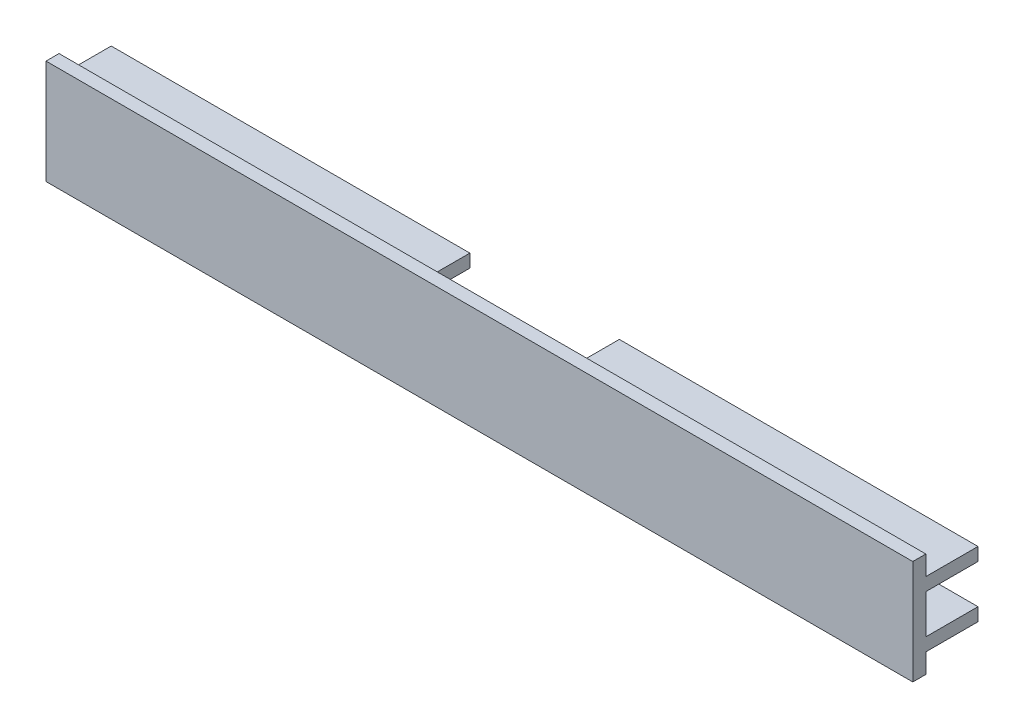
ISO-10303-21;
HEADER;
FILE_DESCRIPTION(('STEP AP214'),'2;1');
FILE_NAME('part.step','',(''),(''),'','','');
FILE_SCHEMA(('AUTOMOTIVE_DESIGN { 1 0 10303 214 1 1 1 1 }'));
ENDSEC;
DATA;
#1=APPLICATION_CONTEXT('core data for automotive mechanical design processes');
#2=APPLICATION_PROTOCOL_DEFINITION('international standard','automotive_design',2000,#1);
#3=PRODUCT_CONTEXT('',#1,'mechanical');
#4=PRODUCT('Part','Part','',(#3));
#5=PRODUCT_RELATED_PRODUCT_CATEGORY('part','',(#4));
#6=PRODUCT_DEFINITION_FORMATION('','',#4);
#7=PRODUCT_DEFINITION_CONTEXT('part definition',#1,'design');
#8=PRODUCT_DEFINITION('design','',#6,#7);
#9=PRODUCT_DEFINITION_SHAPE('','',#8);
#10=(LENGTH_UNIT() NAMED_UNIT(*) SI_UNIT(.MILLI.,.METRE.));
#11=(NAMED_UNIT(*) PLANE_ANGLE_UNIT() SI_UNIT($,.RADIAN.));
#12=(NAMED_UNIT(*) SI_UNIT($,.STERADIAN.) SOLID_ANGLE_UNIT());
#13=UNCERTAINTY_MEASURE_WITH_UNIT(LENGTH_MEASURE(1.E-05),#10,'distance_accuracy_value','');
#14=(GEOMETRIC_REPRESENTATION_CONTEXT(3) GLOBAL_UNCERTAINTY_ASSIGNED_CONTEXT((#13)) GLOBAL_UNIT_ASSIGNED_CONTEXT((#10,
#11,#12)) REPRESENTATION_CONTEXT('',''));
#15=CARTESIAN_POINT('',(0.,0.,0.));
#16=DIRECTION('',(0.,0.,1.));
#17=DIRECTION('',(1.,0.,0.));
#18=AXIS2_PLACEMENT_3D('',#15,#16,#17);
#19=CARTESIAN_POINT('',(66.46,-3.,-5.));
#20=DIRECTION('',(0.,0.,1.));
#21=DIRECTION('',(1.,0.,0.));
#22=AXIS2_PLACEMENT_3D('',#19,#20,#21);
#23=PLANE('',#22);
#24=DIRECTION('',(-1.,0.,0.));
#25=VECTOR('',#24,1.);
#26=CARTESIAN_POINT('',(66.46,-5.,-5.));
#27=LINE('',#26,#25);
#28=CARTESIAN_POINT('',(66.46,-5.,-5.));
#29=VERTEX_POINT('',#28);
#30=CARTESIAN_POINT('',(11.46,-5.,-5.));
#31=VERTEX_POINT('',#30);
#32=EDGE_CURVE('E355',#29,#31,#27,.T.);
#33=ORIENTED_EDGE('',*,*,#32,.T.);
#34=DIRECTION('',(0.,-1.,0.));
#35=VECTOR('',#34,1.);
#36=CARTESIAN_POINT('',(11.46,5.,-5.));
#37=LINE('',#36,#35);
#38=CARTESIAN_POINT('',(11.46,-3.,-5.));
#39=VERTEX_POINT('',#38);
#40=EDGE_CURVE('E421',#39,#31,#37,.T.);
#41=ORIENTED_EDGE('',*,*,#40,.F.);
#42=DIRECTION('',(-1.,0.,0.));
#43=VECTOR('',#42,1.);
#44=CARTESIAN_POINT('',(66.46,-3.,-5.));
#45=LINE('',#44,#43);
#46=CARTESIAN_POINT('',(66.46,-3.,-5.));
#47=VERTEX_POINT('',#46);
#48=EDGE_CURVE('E351',#47,#39,#45,.T.);
#49=ORIENTED_EDGE('',*,*,#48,.F.);
#50=DIRECTION('',(0.,1.,0.));
#51=VECTOR('',#50,1.);
#52=CARTESIAN_POINT('',(66.46,-3.,-5.));
#53=LINE('',#52,#51);
#54=EDGE_CURVE('E296',#29,#47,#53,.T.);
#55=ORIENTED_EDGE('',*,*,#54,.F.);
#56=EDGE_LOOP('',(#33,#41,#49,#55));
#57=FACE_BOUND('',#56,.T.);
#58=ADVANCED_FACE('F34',(#57),#23,.F.);
#59=CARTESIAN_POINT('',(66.46,-3.,2.));
#60=DIRECTION('',(0.,-1.,0.));
#61=DIRECTION('',(0.,0.,-1.));
#62=AXIS2_PLACEMENT_3D('',#59,#60,#61);
#63=PLANE('',#62);
#64=DIRECTION('',(0.,0.,1.));
#65=VECTOR('',#64,1.);
#66=CARTESIAN_POINT('',(11.46,-3.,2.));
#67=LINE('',#66,#65);
#68=CARTESIAN_POINT('',(11.46,-3.,2.));
#69=VERTEX_POINT('',#68);
#70=EDGE_CURVE('E242',#39,#69,#67,.T.);
#71=ORIENTED_EDGE('',*,*,#70,.T.);
#72=DIRECTION('',(-1.,0.,0.));
#73=VECTOR('',#72,1.);
#74=CARTESIAN_POINT('',(66.46,-3.,2.));
#75=LINE('',#74,#73);
#76=CARTESIAN_POINT('',(9.95999999999999,-3.,2.));
#77=VERTEX_POINT('',#76);
#78=EDGE_CURVE('E232',#69,#77,#75,.T.);
#79=ORIENTED_EDGE('',*,*,#78,.T.);
#80=DIRECTION('',(0.,0.,-1.));
#81=VECTOR('',#80,1.);
#82=CARTESIAN_POINT('',(9.95999999999999,-3.,3.));
#83=LINE('',#82,#81);
#84=CARTESIAN_POINT('',(9.95999999999999,-3.,3.));
#85=VERTEX_POINT('',#84);
#86=EDGE_CURVE('E259',#85,#77,#83,.T.);
#87=ORIENTED_EDGE('',*,*,#86,.F.);
#88=DIRECTION('',(1.,0.,0.));
#89=VECTOR('',#88,1.);
#90=CARTESIAN_POINT('',(9.95999999999999,-3.,3.));
#91=LINE('',#90,#89);
#92=CARTESIAN_POINT('',(66.46,-3.,3.));
#93=VERTEX_POINT('',#92);
#94=EDGE_CURVE('E265',#85,#93,#91,.T.);
#95=ORIENTED_EDGE('',*,*,#94,.T.);
#96=DIRECTION('',(0.,0.,1.));
#97=VECTOR('',#96,1.);
#98=CARTESIAN_POINT('',(66.46,-3.,2.));
#99=LINE('',#98,#97);
#100=EDGE_CURVE('E298',#47,#93,#99,.T.);
#101=ORIENTED_EDGE('',*,*,#100,.F.);
#102=ORIENTED_EDGE('',*,*,#48,.T.);
#103=EDGE_LOOP('',(#71,#79,#87,#95,#101,#102));
#104=FACE_BOUND('',#103,.T.);
#105=ADVANCED_FACE('F439',(#104),#63,.F.);
#106=CARTESIAN_POINT('',(66.46,3.,-5.));
#107=DIRECTION('',(0.,1.,0.));
#108=DIRECTION('',(0.,0.,1.));
#109=AXIS2_PLACEMENT_3D('',#106,#107,#108);
#110=PLANE('',#109);
#111=DIRECTION('',(0.,0.,1.));
#112=VECTOR('',#111,1.);
#113=CARTESIAN_POINT('',(9.95999999999999,3.,2.));
#114=LINE('',#113,#112);
#115=CARTESIAN_POINT('',(9.95999999999999,3.,2.));
#116=VERTEX_POINT('',#115);
#117=CARTESIAN_POINT('',(9.95999999999999,3.,3.));
#118=VERTEX_POINT('',#117);
#119=EDGE_CURVE('E256',#116,#118,#114,.T.);
#120=ORIENTED_EDGE('',*,*,#119,.F.);
#121=DIRECTION('',(1.,0.,0.));
#122=VECTOR('',#121,1.);
#123=CARTESIAN_POINT('',(66.46,3.,2.));
#124=LINE('',#123,#122);
#125=CARTESIAN_POINT('',(11.46,3.,2.));
#126=VERTEX_POINT('',#125);
#127=EDGE_CURVE('E233',#116,#126,#124,.T.);
#128=ORIENTED_EDGE('',*,*,#127,.T.);
#129=DIRECTION('',(0.,0.,-1.));
#130=VECTOR('',#129,1.);
#131=CARTESIAN_POINT('',(11.46,3.,-5.));
#132=LINE('',#131,#130);
#133=CARTESIAN_POINT('',(11.46,3.,-5.));
#134=VERTEX_POINT('',#133);
#135=EDGE_CURVE('E202',#126,#134,#132,.T.);
#136=ORIENTED_EDGE('',*,*,#135,.T.);
#137=DIRECTION('',(-1.,0.,0.));
#138=VECTOR('',#137,1.);
#139=CARTESIAN_POINT('',(66.46,3.,-5.));
#140=LINE('',#139,#138);
#141=CARTESIAN_POINT('',(66.46,3.,-5.));
#142=VERTEX_POINT('',#141);
#143=EDGE_CURVE('E347',#142,#134,#140,.T.);
#144=ORIENTED_EDGE('',*,*,#143,.F.);
#145=DIRECTION('',(0.,0.,-1.));
#146=VECTOR('',#145,1.);
#147=CARTESIAN_POINT('',(66.46,3.,-5.));
#148=LINE('',#147,#146);
#149=CARTESIAN_POINT('',(66.46,3.,3.));
#150=VERTEX_POINT('',#149);
#151=EDGE_CURVE('E300',#150,#142,#148,.T.);
#152=ORIENTED_EDGE('',*,*,#151,.F.);
#153=DIRECTION('',(1.,0.,0.));
#154=VECTOR('',#153,1.);
#155=CARTESIAN_POINT('',(9.95999999999999,3.,3.));
#156=LINE('',#155,#154);
#157=EDGE_CURVE('E262',#118,#150,#156,.T.);
#158=ORIENTED_EDGE('',*,*,#157,.F.);
#159=EDGE_LOOP('',(#120,#128,#136,#144,#152,#158));
#160=FACE_BOUND('',#159,.T.);
#161=ADVANCED_FACE('F449',(#160),#110,.F.);
#162=CARTESIAN_POINT('',(66.46,5.,-5.));
#163=DIRECTION('',(0.,0.,1.));
#164=DIRECTION('',(1.,0.,0.));
#165=AXIS2_PLACEMENT_3D('',#162,#163,#164);
#166=PLANE('',#165);
#167=ORIENTED_EDGE('',*,*,#143,.T.);
#168=CARTESIAN_POINT('',(11.46,5.,-5.));
#169=VERTEX_POINT('',#168);
#170=EDGE_CURVE('E215',#169,#134,#37,.T.);
#171=ORIENTED_EDGE('',*,*,#170,.F.);
#172=DIRECTION('',(-1.,0.,0.));
#173=VECTOR('',#172,1.);
#174=CARTESIAN_POINT('',(66.46,5.,-5.));
#175=LINE('',#174,#173);
#176=CARTESIAN_POINT('',(66.46,5.,-5.));
#177=VERTEX_POINT('',#176);
#178=EDGE_CURVE('E221',#177,#169,#175,.T.);
#179=ORIENTED_EDGE('',*,*,#178,.F.);
#180=DIRECTION('',(0.,1.,0.));
#181=VECTOR('',#180,1.);
#182=CARTESIAN_POINT('',(66.46,5.,-5.));
#183=LINE('',#182,#181);
#184=EDGE_CURVE('E302',#142,#177,#183,.T.);
#185=ORIENTED_EDGE('',*,*,#184,.F.);
#186=EDGE_LOOP('',(#167,#171,#179,#185));
#187=FACE_BOUND('',#186,.T.);
#188=ADVANCED_FACE('F452',(#187),#166,.F.);
#189=CARTESIAN_POINT('',(66.46,3.,2.));
#190=DIRECTION('',(0.,0.,1.));
#191=DIRECTION('',(0.,-1.,0.));
#192=AXIS2_PLACEMENT_3D('',#189,#190,#191);
#193=PLANE('',#192);
#194=CARTESIAN_POINT('',(9.95999999999999,0.,2.));
#195=DIRECTION('',(0.,0.,-1.));
#196=DIRECTION('',(0.,1.,0.));
#197=AXIS2_PLACEMENT_3D('',#194,#195,#196);
#198=CIRCLE('',#197,3.);
#199=EDGE_CURVE('E250',#77,#116,#198,.T.);
#200=ORIENTED_EDGE('',*,*,#199,.F.);
#201=ORIENTED_EDGE('',*,*,#78,.F.);
#202=DIRECTION('',(0.,-1.,0.));
#203=VECTOR('',#202,1.);
#204=CARTESIAN_POINT('',(11.46,5.,2.));
#205=LINE('',#204,#203);
#206=CARTESIAN_POINT('',(11.46,-5.,2.));
#207=VERTEX_POINT('',#206);
#208=EDGE_CURVE('E206',#69,#207,#205,.T.);
#209=ORIENTED_EDGE('',*,*,#208,.T.);
#210=DIRECTION('',(-1.,0.,0.));
#211=VECTOR('',#210,1.);
#212=CARTESIAN_POINT('',(11.46,-5.,2.));
#213=LINE('',#212,#211);
#214=CARTESIAN_POINT('',(-11.46,-5.,2.));
#215=VERTEX_POINT('',#214);
#216=EDGE_CURVE('E427',#207,#215,#213,.T.);
#217=ORIENTED_EDGE('',*,*,#216,.T.);
#218=DIRECTION('',(0.,1.,0.));
#219=VECTOR('',#218,1.);
#220=CARTESIAN_POINT('',(-11.46,5.,2.));
#221=LINE('',#220,#219);
#222=CARTESIAN_POINT('',(-11.46,-3.,2.));
#223=VERTEX_POINT('',#222);
#224=EDGE_CURVE('E229',#215,#223,#221,.T.);
#225=ORIENTED_EDGE('',*,*,#224,.T.);
#226=CARTESIAN_POINT('',(-9.95999999999999,-3.,2.));
#227=VERTEX_POINT('',#226);
#228=EDGE_CURVE('E228',#227,#223,#75,.T.);
#229=ORIENTED_EDGE('',*,*,#228,.F.);
#230=CARTESIAN_POINT('',(-9.95999999999999,0.,2.));
#231=DIRECTION('',(0.,0.,-1.));
#232=DIRECTION('',(0.,1.,0.));
#233=AXIS2_PLACEMENT_3D('',#230,#231,#232);
#234=CIRCLE('',#233,3.);
#235=CARTESIAN_POINT('',(-9.95999999999999,3.,2.));
#236=VERTEX_POINT('',#235);
#237=EDGE_CURVE('E245',#236,#227,#234,.T.);
#238=ORIENTED_EDGE('',*,*,#237,.F.);
#239=CARTESIAN_POINT('',(-11.46,3.,2.));
#240=VERTEX_POINT('',#239);
#241=EDGE_CURVE('E230',#240,#236,#124,.T.);
#242=ORIENTED_EDGE('',*,*,#241,.F.);
#243=CARTESIAN_POINT('',(-11.46,5.,2.));
#244=VERTEX_POINT('',#243);
#245=EDGE_CURVE('E213',#240,#244,#221,.T.);
#246=ORIENTED_EDGE('',*,*,#245,.T.);
#247=DIRECTION('',(1.,0.,0.));
#248=VECTOR('',#247,1.);
#249=CARTESIAN_POINT('',(11.46,5.,2.));
#250=LINE('',#249,#248);
#251=CARTESIAN_POINT('',(11.46,5.,2.));
#252=VERTEX_POINT('',#251);
#253=EDGE_CURVE('E209',#244,#252,#250,.T.);
#254=ORIENTED_EDGE('',*,*,#253,.T.);
#255=EDGE_CURVE('E195',#252,#126,#205,.T.);
#256=ORIENTED_EDGE('',*,*,#255,.T.);
#257=ORIENTED_EDGE('',*,*,#127,.F.);
#258=EDGE_LOOP('',(#200,#201,#209,#217,#225,#229,#238,#242,#246,#254,#256,#257));
#259=FACE_BOUND('',#258,.T.);
#260=ADVANCED_FACE('F211',(#259),#193,.F.);
#261=CARTESIAN_POINT('',(66.46,8.,5.));
#262=DIRECTION('',(0.,0.,-1.));
#263=DIRECTION('',(-1.,0.,0.));
#264=AXIS2_PLACEMENT_3D('',#261,#262,#263);
#265=PLANE('',#264);
#266=DIRECTION('',(0.,-1.,0.));
#267=VECTOR('',#266,1.);
#268=CARTESIAN_POINT('',(-66.46,8.,5.));
#269=LINE('',#268,#267);
#270=CARTESIAN_POINT('',(-66.46,8.,5.));
#271=VERTEX_POINT('',#270);
#272=CARTESIAN_POINT('',(-66.46,-8.,5.));
#273=VERTEX_POINT('',#272);
#274=EDGE_CURVE('E283',#271,#273,#269,.T.);
#275=ORIENTED_EDGE('',*,*,#274,.T.);
#276=DIRECTION('',(-1.,0.,0.));
#277=VECTOR('',#276,1.);
#278=CARTESIAN_POINT('',(66.46,-8.,5.));
#279=LINE('',#278,#277);
#280=CARTESIAN_POINT('',(66.46,-8.,5.));
#281=VERTEX_POINT('',#280);
#282=EDGE_CURVE('E11',#281,#273,#279,.T.);
#283=ORIENTED_EDGE('',*,*,#282,.F.);
#284=DIRECTION('',(0.,-1.,0.));
#285=VECTOR('',#284,1.);
#286=CARTESIAN_POINT('',(66.46,8.,5.));
#287=LINE('',#286,#285);
#288=CARTESIAN_POINT('',(66.46,8.,5.));
#289=VERTEX_POINT('',#288);
#290=EDGE_CURVE('E286',#289,#281,#287,.T.);
#291=ORIENTED_EDGE('',*,*,#290,.F.);
#292=DIRECTION('',(-1.,0.,0.));
#293=VECTOR('',#292,1.);
#294=CARTESIAN_POINT('',(66.46,8.,5.));
#295=LINE('',#294,#293);
#296=EDGE_CURVE('E310',#289,#271,#295,.T.);
#297=ORIENTED_EDGE('',*,*,#296,.T.);
#298=EDGE_LOOP('',(#275,#283,#291,#297));
#299=FACE_BOUND('',#298,.T.);
#300=ADVANCED_FACE('F36',(#299),#265,.F.);
#301=CARTESIAN_POINT('',(66.46,-8.,5.));
#302=DIRECTION('',(0.,1.,0.));
#303=DIRECTION('',(0.,0.,1.));
#304=AXIS2_PLACEMENT_3D('',#301,#302,#303);
#305=PLANE('',#304);
#306=DIRECTION('',(0.,0.,-1.));
#307=VECTOR('',#306,1.);
#308=CARTESIAN_POINT('',(-66.46,-8.,5.));
#309=LINE('',#308,#307);
#310=CARTESIAN_POINT('',(-66.46,-8.,3.));
#311=VERTEX_POINT('',#310);
#312=EDGE_CURVE('E313',#273,#311,#309,.T.);
#313=ORIENTED_EDGE('',*,*,#312,.T.);
#314=DIRECTION('',(-1.,0.,0.));
#315=VECTOR('',#314,1.);
#316=CARTESIAN_POINT('',(66.46,-8.,3.));
#317=LINE('',#316,#315);
#318=CARTESIAN_POINT('',(66.46,-8.,3.));
#319=VERTEX_POINT('',#318);
#320=EDGE_CURVE('E42',#319,#311,#317,.T.);
#321=ORIENTED_EDGE('',*,*,#320,.F.);
#322=DIRECTION('',(0.,0.,-1.));
#323=VECTOR('',#322,1.);
#324=CARTESIAN_POINT('',(66.46,-8.,5.));
#325=LINE('',#324,#323);
#326=EDGE_CURVE('E289',#281,#319,#325,.T.);
#327=ORIENTED_EDGE('',*,*,#326,.F.);
#328=ORIENTED_EDGE('',*,*,#282,.T.);
#329=EDGE_LOOP('',(#313,#321,#327,#328));
#330=FACE_BOUND('',#329,.T.);
#331=ADVANCED_FACE('F388',(#330),#305,.F.);
#332=CARTESIAN_POINT('',(66.46,-5.,3.));
#333=DIRECTION('',(0.,0.,1.));
#334=DIRECTION('',(0.,-1.,0.));
#335=AXIS2_PLACEMENT_3D('',#332,#333,#334);
#336=PLANE('',#335);
#337=DIRECTION('',(0.,1.,0.));
#338=VECTOR('',#337,1.);
#339=CARTESIAN_POINT('',(-66.46,-5.,3.));
#340=LINE('',#339,#338);
#341=CARTESIAN_POINT('',(-66.46,-5.,3.));
#342=VERTEX_POINT('',#341);
#343=EDGE_CURVE('E315',#311,#342,#340,.T.);
#344=ORIENTED_EDGE('',*,*,#343,.T.);
#345=DIRECTION('',(-1.,0.,0.));
#346=VECTOR('',#345,1.);
#347=CARTESIAN_POINT('',(66.46,-5.,3.));
#348=LINE('',#347,#346);
#349=CARTESIAN_POINT('',(66.46,-5.,3.));
#350=VERTEX_POINT('',#349);
#351=EDGE_CURVE('E358',#350,#342,#348,.T.);
#352=ORIENTED_EDGE('',*,*,#351,.F.);
#353=DIRECTION('',(0.,1.,0.));
#354=VECTOR('',#353,1.);
#355=CARTESIAN_POINT('',(66.46,-5.,3.));
#356=LINE('',#355,#354);
#357=EDGE_CURVE('E292',#319,#350,#356,.T.);
#358=ORIENTED_EDGE('',*,*,#357,.F.);
#359=ORIENTED_EDGE('',*,*,#320,.T.);
#360=EDGE_LOOP('',(#344,#352,#358,#359));
#361=FACE_BOUND('',#360,.T.);
#362=ADVANCED_FACE('F365',(#361),#336,.F.);
#363=CARTESIAN_POINT('',(66.46,-5.,-5.));
#364=DIRECTION('',(0.,1.,0.));
#365=DIRECTION('',(0.,0.,1.));
#366=AXIS2_PLACEMENT_3D('',#363,#364,#365);
#367=PLANE('',#366);
#368=ORIENTED_EDGE('',*,*,#216,.F.);
#369=DIRECTION('',(0.,0.,-1.));
#370=VECTOR('',#369,1.);
#371=CARTESIAN_POINT('',(11.46,-5.,27.0065271479268));
#372=LINE('',#371,#370);
#373=EDGE_CURVE('E205',#207,#31,#372,.T.);
#374=ORIENTED_EDGE('',*,*,#373,.T.);
#375=ORIENTED_EDGE('',*,*,#32,.F.);
#376=DIRECTION('',(0.,0.,-1.));
#377=VECTOR('',#376,1.);
#378=CARTESIAN_POINT('',(66.46,-5.,-5.));
#379=LINE('',#378,#377);
#380=EDGE_CURVE('E294',#350,#29,#379,.T.);
#381=ORIENTED_EDGE('',*,*,#380,.F.);
#382=ORIENTED_EDGE('',*,*,#351,.T.);
#383=DIRECTION('',(0.,0.,-1.));
#384=VECTOR('',#383,1.);
#385=CARTESIAN_POINT('',(-66.46,-5.,-5.));
#386=LINE('',#385,#384);
#387=CARTESIAN_POINT('',(-66.46,-5.,-5.));
#388=VERTEX_POINT('',#387);
#389=EDGE_CURVE('E317',#342,#388,#386,.T.);
#390=ORIENTED_EDGE('',*,*,#389,.T.);
#391=CARTESIAN_POINT('',(-11.46,-5.,-5.));
#392=VERTEX_POINT('',#391);
#393=EDGE_CURVE('E354',#392,#388,#27,.T.);
#394=ORIENTED_EDGE('',*,*,#393,.F.);
#395=DIRECTION('',(0.,0.,-1.));
#396=VECTOR('',#395,1.);
#397=CARTESIAN_POINT('',(-11.46,-5.,27.0065271479268));
#398=LINE('',#397,#396);
#399=EDGE_CURVE('E429',#215,#392,#398,.T.);
#400=ORIENTED_EDGE('',*,*,#399,.F.);
#401=EDGE_LOOP('',(#368,#374,#375,#381,#382,#390,#394,#400));
#402=FACE_BOUND('',#401,.T.);
#403=ADVANCED_FACE('F377',(#402),#367,.F.);
#404=CARTESIAN_POINT('',(-11.46,-3.,-5.));
#405=VERTEX_POINT('',#404);
#406=CARTESIAN_POINT('',(-66.46,-3.,-5.));
#407=VERTEX_POINT('',#406);
#408=EDGE_CURVE('E350',#405,#407,#45,.T.);
#409=ORIENTED_EDGE('',*,*,#408,.F.);
#410=DIRECTION('',(0.,1.,0.));
#411=VECTOR('',#410,1.);
#412=CARTESIAN_POINT('',(-11.46,5.,-5.));
#413=LINE('',#412,#411);
#414=EDGE_CURVE('E49',#392,#405,#413,.T.);
#415=ORIENTED_EDGE('',*,*,#414,.F.);
#416=ORIENTED_EDGE('',*,*,#393,.T.);
#417=DIRECTION('',(0.,1.,0.));
#418=VECTOR('',#417,1.);
#419=CARTESIAN_POINT('',(-66.46,-3.,-5.));
#420=LINE('',#419,#418);
#421=EDGE_CURVE('E320',#388,#407,#420,.T.);
#422=ORIENTED_EDGE('',*,*,#421,.T.);
#423=EDGE_LOOP('',(#409,#415,#416,#422));
#424=FACE_BOUND('',#423,.T.);
#425=ADVANCED_FACE('F420',(#424),#23,.F.);
#426=DIRECTION('',(0.,0.,1.));
#427=VECTOR('',#426,1.);
#428=CARTESIAN_POINT('',(-9.95999999999999,-3.,3.));
#429=LINE('',#428,#427);
#430=CARTESIAN_POINT('',(-9.95999999999999,-3.,3.));
#431=VERTEX_POINT('',#430);
#432=EDGE_CURVE('E271',#227,#431,#429,.T.);
#433=ORIENTED_EDGE('',*,*,#432,.F.);
#434=ORIENTED_EDGE('',*,*,#228,.T.);
#435=DIRECTION('',(0.,0.,-1.));
#436=VECTOR('',#435,1.);
#437=CARTESIAN_POINT('',(-11.46,-3.,2.));
#438=LINE('',#437,#436);
#439=EDGE_CURVE('E239',#223,#405,#438,.T.);
#440=ORIENTED_EDGE('',*,*,#439,.T.);
#441=ORIENTED_EDGE('',*,*,#408,.T.);
#442=DIRECTION('',(0.,0.,1.));
#443=VECTOR('',#442,1.);
#444=CARTESIAN_POINT('',(-66.46,-3.,2.));
#445=LINE('',#444,#443);
#446=CARTESIAN_POINT('',(-66.46,-3.,3.));
#447=VERTEX_POINT('',#446);
#448=EDGE_CURVE('E323',#407,#447,#445,.T.);
#449=ORIENTED_EDGE('',*,*,#448,.T.);
#450=DIRECTION('',(-1.,0.,0.));
#451=VECTOR('',#450,1.);
#452=CARTESIAN_POINT('',(-9.95999999999999,-3.,3.));
#453=LINE('',#452,#451);
#454=EDGE_CURVE('E277',#431,#447,#453,.T.);
#455=ORIENTED_EDGE('',*,*,#454,.F.);
#456=EDGE_LOOP('',(#433,#434,#440,#441,#449,#455));
#457=FACE_BOUND('',#456,.T.);
#458=ADVANCED_FACE('F417',(#457),#63,.F.);
#459=DIRECTION('',(0.,0.,1.));
#460=VECTOR('',#459,1.);
#461=CARTESIAN_POINT('',(-11.46,3.,-5.));
#462=LINE('',#461,#460);
#463=CARTESIAN_POINT('',(-11.46,3.,-5.));
#464=VERTEX_POINT('',#463);
#465=EDGE_CURVE('E236',#464,#240,#462,.T.);
#466=ORIENTED_EDGE('',*,*,#465,.T.);
#467=ORIENTED_EDGE('',*,*,#241,.T.);
#468=DIRECTION('',(0.,0.,-1.));
#469=VECTOR('',#468,1.);
#470=CARTESIAN_POINT('',(-9.95999999999999,3.,2.));
#471=LINE('',#470,#469);
#472=CARTESIAN_POINT('',(-9.95999999999999,3.,3.));
#473=VERTEX_POINT('',#472);
#474=EDGE_CURVE('E274',#473,#236,#471,.T.);
#475=ORIENTED_EDGE('',*,*,#474,.F.);
#476=DIRECTION('',(-1.,0.,0.));
#477=VECTOR('',#476,1.);
#478=CARTESIAN_POINT('',(-9.95999999999999,3.,3.));
#479=LINE('',#478,#477);
#480=CARTESIAN_POINT('',(-66.46,3.,3.));
#481=VERTEX_POINT('',#480);
#482=EDGE_CURVE('E280',#473,#481,#479,.T.);
#483=ORIENTED_EDGE('',*,*,#482,.T.);
#484=DIRECTION('',(0.,0.,-1.));
#485=VECTOR('',#484,1.);
#486=CARTESIAN_POINT('',(-66.46,3.,-5.));
#487=LINE('',#486,#485);
#488=CARTESIAN_POINT('',(-66.46,3.,-5.));
#489=VERTEX_POINT('',#488);
#490=EDGE_CURVE('E325',#481,#489,#487,.T.);
#491=ORIENTED_EDGE('',*,*,#490,.T.);
#492=EDGE_CURVE('E346',#464,#489,#140,.T.);
#493=ORIENTED_EDGE('',*,*,#492,.F.);
#494=EDGE_LOOP('',(#466,#467,#475,#483,#491,#493));
#495=FACE_BOUND('',#494,.T.);
#496=ADVANCED_FACE('F409',(#495),#110,.F.);
#497=CARTESIAN_POINT('',(-11.46,5.,-5.));
#498=VERTEX_POINT('',#497);
#499=CARTESIAN_POINT('',(-66.46,5.,-5.));
#500=VERTEX_POINT('',#499);
#501=EDGE_CURVE('E344',#498,#500,#175,.T.);
#502=ORIENTED_EDGE('',*,*,#501,.F.);
#503=EDGE_CURVE('E57',#464,#498,#413,.T.);
#504=ORIENTED_EDGE('',*,*,#503,.F.);
#505=ORIENTED_EDGE('',*,*,#492,.T.);
#506=DIRECTION('',(0.,1.,0.));
#507=VECTOR('',#506,1.);
#508=CARTESIAN_POINT('',(-66.46,5.,-5.));
#509=LINE('',#508,#507);
#510=EDGE_CURVE('E328',#489,#500,#509,.T.);
#511=ORIENTED_EDGE('',*,*,#510,.T.);
#512=EDGE_LOOP('',(#502,#504,#505,#511));
#513=FACE_BOUND('',#512,.T.);
#514=ADVANCED_FACE('F406',(#513),#166,.F.);
#515=CARTESIAN_POINT('',(66.46,5.,3.));
#516=DIRECTION('',(0.,-1.,0.));
#517=DIRECTION('',(0.,0.,-1.));
#518=AXIS2_PLACEMENT_3D('',#515,#516,#517);
#519=PLANE('',#518);
#520=ORIENTED_EDGE('',*,*,#178,.T.);
#521=DIRECTION('',(0.,0.,-1.));
#522=VECTOR('',#521,1.);
#523=CARTESIAN_POINT('',(11.46,5.,27.0065271479268));
#524=LINE('',#523,#522);
#525=EDGE_CURVE('E199',#252,#169,#524,.T.);
#526=ORIENTED_EDGE('',*,*,#525,.F.);
#527=ORIENTED_EDGE('',*,*,#253,.F.);
#528=DIRECTION('',(0.,0.,-1.));
#529=VECTOR('',#528,1.);
#530=CARTESIAN_POINT('',(-11.46,5.,27.0065271479268));
#531=LINE('',#530,#529);
#532=EDGE_CURVE('E226',#244,#498,#531,.T.);
#533=ORIENTED_EDGE('',*,*,#532,.T.);
#534=ORIENTED_EDGE('',*,*,#501,.T.);
#535=DIRECTION('',(0.,0.,1.));
#536=VECTOR('',#535,1.);
#537=CARTESIAN_POINT('',(-66.46,5.,3.));
#538=LINE('',#537,#536);
#539=CARTESIAN_POINT('',(-66.46,5.,3.));
#540=VERTEX_POINT('',#539);
#541=EDGE_CURVE('E331',#500,#540,#538,.T.);
#542=ORIENTED_EDGE('',*,*,#541,.T.);
#543=DIRECTION('',(-1.,0.,0.));
#544=VECTOR('',#543,1.);
#545=CARTESIAN_POINT('',(66.46,5.,3.));
#546=LINE('',#545,#544);
#547=CARTESIAN_POINT('',(66.46,5.,3.));
#548=VERTEX_POINT('',#547);
#549=EDGE_CURVE('E341',#548,#540,#546,.T.);
#550=ORIENTED_EDGE('',*,*,#549,.F.);
#551=DIRECTION('',(0.,0.,1.));
#552=VECTOR('',#551,1.);
#553=CARTESIAN_POINT('',(66.46,5.,3.));
#554=LINE('',#553,#552);
#555=EDGE_CURVE('E304',#177,#548,#554,.T.);
#556=ORIENTED_EDGE('',*,*,#555,.F.);
#557=EDGE_LOOP('',(#520,#526,#527,#533,#534,#542,#550,#556));
#558=FACE_BOUND('',#557,.T.);
#559=ADVANCED_FACE('F218',(#558),#519,.F.);
#560=CARTESIAN_POINT('',(66.46,8.,3.));
#561=DIRECTION('',(0.,0.,1.));
#562=DIRECTION('',(0.,-1.,0.));
#563=AXIS2_PLACEMENT_3D('',#560,#561,#562);
#564=PLANE('',#563);
#565=DIRECTION('',(0.,1.,0.));
#566=VECTOR('',#565,1.);
#567=CARTESIAN_POINT('',(-66.46,8.,3.));
#568=LINE('',#567,#566);
#569=CARTESIAN_POINT('',(-66.46,8.,3.));
#570=VERTEX_POINT('',#569);
#571=EDGE_CURVE('E333',#540,#570,#568,.T.);
#572=ORIENTED_EDGE('',*,*,#571,.T.);
#573=DIRECTION('',(-1.,0.,0.));
#574=VECTOR('',#573,1.);
#575=CARTESIAN_POINT('',(66.46,8.,3.));
#576=LINE('',#575,#574);
#577=CARTESIAN_POINT('',(66.46,8.,3.));
#578=VERTEX_POINT('',#577);
#579=EDGE_CURVE('E338',#578,#570,#576,.T.);
#580=ORIENTED_EDGE('',*,*,#579,.F.);
#581=DIRECTION('',(0.,1.,0.));
#582=VECTOR('',#581,1.);
#583=CARTESIAN_POINT('',(66.46,8.,3.));
#584=LINE('',#583,#582);
#585=EDGE_CURVE('E306',#548,#578,#584,.T.);
#586=ORIENTED_EDGE('',*,*,#585,.F.);
#587=ORIENTED_EDGE('',*,*,#549,.T.);
#588=EDGE_LOOP('',(#572,#580,#586,#587));
#589=FACE_BOUND('',#588,.T.);
#590=ADVANCED_FACE('F400',(#589),#564,.F.);
#591=CARTESIAN_POINT('',(66.46,8.,5.));
#592=DIRECTION('',(0.,-1.,0.));
#593=DIRECTION('',(0.,0.,-1.));
#594=AXIS2_PLACEMENT_3D('',#591,#592,#593);
#595=PLANE('',#594);
#596=DIRECTION('',(0.,0.,1.));
#597=VECTOR('',#596,1.);
#598=CARTESIAN_POINT('',(-66.46,8.,5.));
#599=LINE('',#598,#597);
#600=EDGE_CURVE('E290',#570,#271,#599,.T.);
#601=ORIENTED_EDGE('',*,*,#600,.T.);
#602=ORIENTED_EDGE('',*,*,#296,.F.);
#603=DIRECTION('',(0.,0.,1.));
#604=VECTOR('',#603,1.);
#605=CARTESIAN_POINT('',(66.46,8.,5.));
#606=LINE('',#605,#604);
#607=EDGE_CURVE('E308',#578,#289,#606,.T.);
#608=ORIENTED_EDGE('',*,*,#607,.F.);
#609=ORIENTED_EDGE('',*,*,#579,.T.);
#610=EDGE_LOOP('',(#601,#602,#608,#609));
#611=FACE_BOUND('',#610,.T.);
#612=ADVANCED_FACE('F395',(#611),#595,.F.);
#613=CARTESIAN_POINT('',(66.46,-8.,5.));
#614=DIRECTION('',(1.,0.,0.));
#615=DIRECTION('',(0.,0.,-1.));
#616=AXIS2_PLACEMENT_3D('',#613,#614,#615);
#617=PLANE('',#616);
#618=ORIENTED_EDGE('',*,*,#100,.T.);
#619=DIRECTION('',(0.,-1.,0.));
#620=VECTOR('',#619,1.);
#621=CARTESIAN_POINT('',(66.46,3.,3.));
#622=LINE('',#621,#620);
#623=EDGE_CURVE('E255',#150,#93,#622,.T.);
#624=ORIENTED_EDGE('',*,*,#623,.F.);
#625=ORIENTED_EDGE('',*,*,#151,.T.);
#626=ORIENTED_EDGE('',*,*,#184,.T.);
#627=ORIENTED_EDGE('',*,*,#555,.T.);
#628=ORIENTED_EDGE('',*,*,#585,.T.);
#629=ORIENTED_EDGE('',*,*,#607,.T.);
#630=ORIENTED_EDGE('',*,*,#290,.T.);
#631=ORIENTED_EDGE('',*,*,#326,.T.);
#632=ORIENTED_EDGE('',*,*,#357,.T.);
#633=ORIENTED_EDGE('',*,*,#380,.T.);
#634=ORIENTED_EDGE('',*,*,#54,.T.);
#635=EDGE_LOOP('',(#618,#624,#625,#626,#627,#628,#629,#630,#631,#632,#633,#634));
#636=FACE_BOUND('',#635,.T.);
#637=ADVANCED_FACE('F384',(#636),#617,.T.);
#638=CARTESIAN_POINT('',(-66.46,-8.,5.));
#639=DIRECTION('',(1.,0.,0.));
#640=DIRECTION('',(0.,0.,-1.));
#641=AXIS2_PLACEMENT_3D('',#638,#639,#640);
#642=PLANE('',#641);
#643=ORIENTED_EDGE('',*,*,#490,.F.);
#644=DIRECTION('',(0.,1.,0.));
#645=VECTOR('',#644,1.);
#646=CARTESIAN_POINT('',(-66.46,3.,3.));
#647=LINE('',#646,#645);
#648=EDGE_CURVE('E268',#447,#481,#647,.T.);
#649=ORIENTED_EDGE('',*,*,#648,.F.);
#650=ORIENTED_EDGE('',*,*,#448,.F.);
#651=ORIENTED_EDGE('',*,*,#421,.F.);
#652=ORIENTED_EDGE('',*,*,#389,.F.);
#653=ORIENTED_EDGE('',*,*,#343,.F.);
#654=ORIENTED_EDGE('',*,*,#312,.F.);
#655=ORIENTED_EDGE('',*,*,#274,.F.);
#656=ORIENTED_EDGE('',*,*,#600,.F.);
#657=ORIENTED_EDGE('',*,*,#571,.F.);
#658=ORIENTED_EDGE('',*,*,#541,.F.);
#659=ORIENTED_EDGE('',*,*,#510,.F.);
#660=EDGE_LOOP('',(#643,#649,#650,#651,#652,#653,#654,#655,#656,#657,#658,#659));
#661=FACE_BOUND('',#660,.T.);
#662=ADVANCED_FACE('F370',(#661),#642,.F.);
#663=CARTESIAN_POINT('',(-9.95999999999999,3.,3.));
#664=DIRECTION('',(0.,0.,1.));
#665=DIRECTION('',(0.,-1.,0.));
#666=AXIS2_PLACEMENT_3D('',#663,#664,#665);
#667=PLANE('',#666);
#668=ORIENTED_EDGE('',*,*,#648,.T.);
#669=ORIENTED_EDGE('',*,*,#482,.F.);
#670=CARTESIAN_POINT('',(-9.95999999999999,0.,3.));
#671=DIRECTION('',(0.,0.,1.));
#672=DIRECTION('',(0.,-1.,0.));
#673=AXIS2_PLACEMENT_3D('',#670,#671,#672);
#674=CIRCLE('',#673,3.);
#675=EDGE_CURVE('E248',#473,#431,#674,.F.);
#676=ORIENTED_EDGE('',*,*,#675,.T.);
#677=ORIENTED_EDGE('',*,*,#454,.T.);
#678=EDGE_LOOP('',(#668,#669,#676,#677));
#679=FACE_BOUND('',#678,.T.);
#680=ADVANCED_FACE('F413',(#679),#667,.F.);
#681=CARTESIAN_POINT('',(9.95999999999999,3.,3.));
#682=DIRECTION('',(0.,0.,1.));
#683=DIRECTION('',(0.,-1.,0.));
#684=AXIS2_PLACEMENT_3D('',#681,#682,#683);
#685=PLANE('',#684);
#686=ORIENTED_EDGE('',*,*,#623,.T.);
#687=ORIENTED_EDGE('',*,*,#94,.F.);
#688=CARTESIAN_POINT('',(9.95999999999999,0.,3.));
#689=DIRECTION('',(0.,0.,1.));
#690=DIRECTION('',(0.,-1.,0.));
#691=AXIS2_PLACEMENT_3D('',#688,#689,#690);
#692=CIRCLE('',#691,3.);
#693=EDGE_CURVE('E253',#85,#118,#692,.F.);
#694=ORIENTED_EDGE('',*,*,#693,.T.);
#695=ORIENTED_EDGE('',*,*,#157,.T.);
#696=EDGE_LOOP('',(#686,#687,#694,#695));
#697=FACE_BOUND('',#696,.T.);
#698=ADVANCED_FACE('F445',(#697),#685,.F.);
#699=CARTESIAN_POINT('',(9.95999999999999,0.,9.70820393249937));
#700=DIRECTION('',(0.,0.,-1.));
#701=DIRECTION('',(0.,1.,0.));
#702=AXIS2_PLACEMENT_3D('',#699,#700,#701);
#703=CYLINDRICAL_SURFACE('',#702,3.);
#704=ORIENTED_EDGE('',*,*,#86,.T.);
#705=ORIENTED_EDGE('',*,*,#199,.T.);
#706=ORIENTED_EDGE('',*,*,#119,.T.);
#707=ORIENTED_EDGE('',*,*,#693,.F.);
#708=EDGE_LOOP('',(#704,#705,#706,#707));
#709=FACE_BOUND('',#708,.T.);
#710=ADVANCED_FACE('F598',(#709),#703,.F.);
#711=CARTESIAN_POINT('',(-9.95999999999999,0.,9.70820393249937));
#712=DIRECTION('',(0.,0.,-1.));
#713=DIRECTION('',(0.,1.,0.));
#714=AXIS2_PLACEMENT_3D('',#711,#712,#713);
#715=CYLINDRICAL_SURFACE('',#714,3.);
#716=ORIENTED_EDGE('',*,*,#474,.T.);
#717=ORIENTED_EDGE('',*,*,#237,.T.);
#718=ORIENTED_EDGE('',*,*,#432,.T.);
#719=ORIENTED_EDGE('',*,*,#675,.F.);
#720=EDGE_LOOP('',(#716,#717,#718,#719));
#721=FACE_BOUND('',#720,.T.);
#722=ADVANCED_FACE('F603',(#721),#715,.F.);
#723=CARTESIAN_POINT('',(11.46,5.,27.0065271479268));
#724=DIRECTION('',(1.,0.,0.));
#725=DIRECTION('',(0.,0.,-1.));
#726=AXIS2_PLACEMENT_3D('',#723,#724,#725);
#727=PLANE('',#726);
#728=ORIENTED_EDGE('',*,*,#255,.F.);
#729=ORIENTED_EDGE('',*,*,#525,.T.);
#730=ORIENTED_EDGE('',*,*,#170,.T.);
#731=ORIENTED_EDGE('',*,*,#135,.F.);
#732=EDGE_LOOP('',(#728,#729,#730,#731));
#733=FACE_BOUND('',#732,.T.);
#734=ADVANCED_FACE('F197',(#733),#727,.F.);
#735=CARTESIAN_POINT('',(-11.46,5.,27.0065271479268));
#736=DIRECTION('',(-1.,0.,0.));
#737=DIRECTION('',(0.,0.,1.));
#738=AXIS2_PLACEMENT_3D('',#735,#736,#737);
#739=PLANE('',#738);
#740=ORIENTED_EDGE('',*,*,#503,.T.);
#741=ORIENTED_EDGE('',*,*,#532,.F.);
#742=ORIENTED_EDGE('',*,*,#245,.F.);
#743=ORIENTED_EDGE('',*,*,#465,.F.);
#744=EDGE_LOOP('',(#740,#741,#742,#743));
#745=FACE_BOUND('',#744,.T.);
#746=ADVANCED_FACE('F625',(#745),#739,.F.);
#747=ORIENTED_EDGE('',*,*,#40,.T.);
#748=ORIENTED_EDGE('',*,*,#373,.F.);
#749=ORIENTED_EDGE('',*,*,#208,.F.);
#750=ORIENTED_EDGE('',*,*,#70,.F.);
#751=EDGE_LOOP('',(#747,#748,#749,#750));
#752=FACE_BOUND('',#751,.T.);
#753=ADVANCED_FACE('F434',(#752),#727,.F.);
#754=ORIENTED_EDGE('',*,*,#224,.F.);
#755=ORIENTED_EDGE('',*,*,#399,.T.);
#756=ORIENTED_EDGE('',*,*,#414,.T.);
#757=ORIENTED_EDGE('',*,*,#439,.F.);
#758=EDGE_LOOP('',(#754,#755,#756,#757));
#759=FACE_BOUND('',#758,.T.);
#760=ADVANCED_FACE('F430',(#759),#739,.F.);
#761=CLOSED_SHELL('',(#58,#105,#161,#188,#260,#300,#331,#362,#403,#425,#458,#496,#514,#559,#590,
#612,#637,#662,#680,#698,#710,#722,#734,#746,#753,#760));
#762=MANIFOLD_SOLID_BREP('B2',#761);
#763=ADVANCED_BREP_SHAPE_REPRESENTATION('',(#18,#762),#14);
#764=SHAPE_DEFINITION_REPRESENTATION(#9,#763);
ENDSEC;
END-ISO-10303-21;
